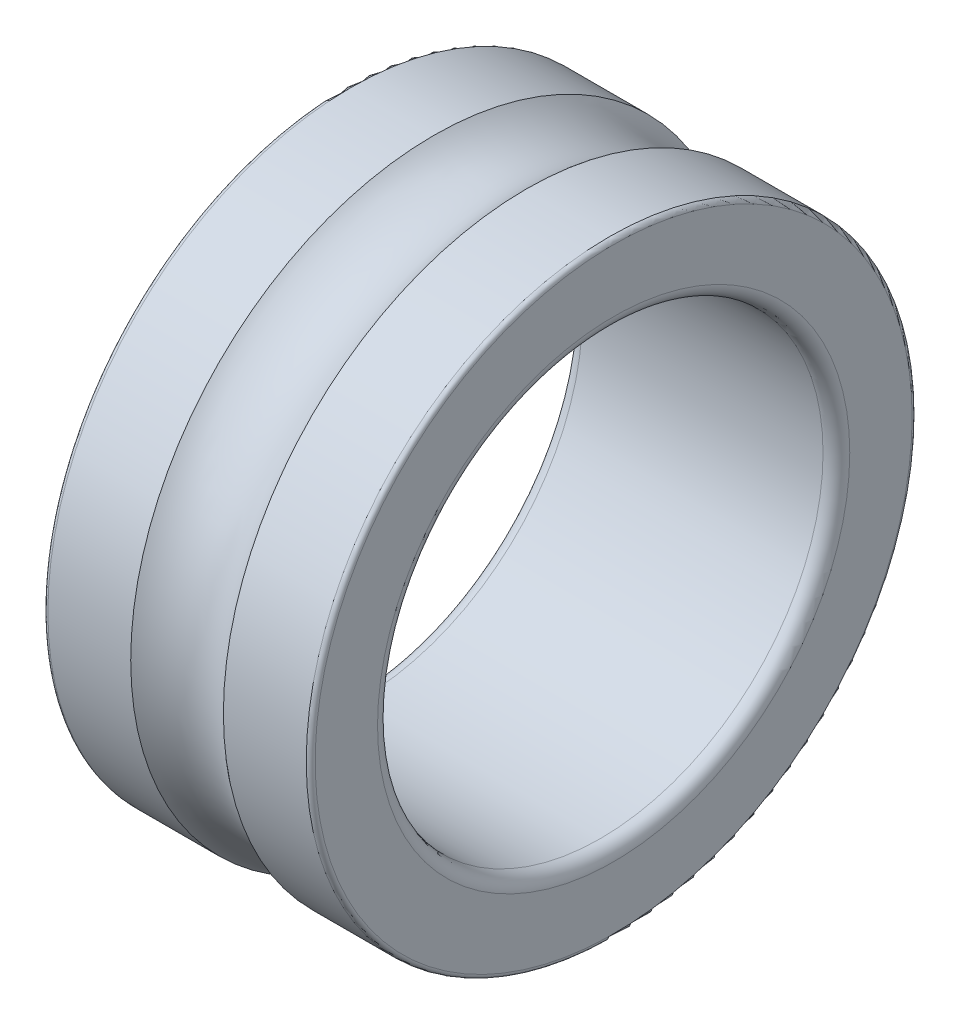
ISO-10303-21;
HEADER;
FILE_DESCRIPTION(('STEP AP214'),'2;1');
FILE_NAME('part.step','',(''),(''),'','','');
FILE_SCHEMA(('AUTOMOTIVE_DESIGN { 1 0 10303 214 1 1 1 1 }'));
ENDSEC;
DATA;
#1=APPLICATION_CONTEXT('core data for automotive mechanical design processes');
#2=APPLICATION_PROTOCOL_DEFINITION('international standard','automotive_design',2000,#1);
#3=PRODUCT_CONTEXT('',#1,'mechanical');
#4=PRODUCT('Part','Part','',(#3));
#5=PRODUCT_RELATED_PRODUCT_CATEGORY('part','',(#4));
#6=PRODUCT_DEFINITION_FORMATION('','',#4);
#7=PRODUCT_DEFINITION_CONTEXT('part definition',#1,'design');
#8=PRODUCT_DEFINITION('design','',#6,#7);
#9=PRODUCT_DEFINITION_SHAPE('','',#8);
#10=(LENGTH_UNIT() NAMED_UNIT(*) SI_UNIT(.MILLI.,.METRE.));
#11=(NAMED_UNIT(*) PLANE_ANGLE_UNIT() SI_UNIT($,.RADIAN.));
#12=(NAMED_UNIT(*) SI_UNIT($,.STERADIAN.) SOLID_ANGLE_UNIT());
#13=UNCERTAINTY_MEASURE_WITH_UNIT(LENGTH_MEASURE(1.E-05),#10,'distance_accuracy_value','');
#14=(GEOMETRIC_REPRESENTATION_CONTEXT(3) GLOBAL_UNCERTAINTY_ASSIGNED_CONTEXT((#13)) GLOBAL_UNIT_ASSIGNED_CONTEXT((#10,
#11,#12)) REPRESENTATION_CONTEXT('',''));
#15=CARTESIAN_POINT('',(0.,0.,0.));
#16=DIRECTION('',(0.,0.,1.));
#17=DIRECTION('',(1.,0.,0.));
#18=AXIS2_PLACEMENT_3D('',#15,#16,#17);
#19=CARTESIAN_POINT('',(1.35,0.,0.));
#20=DIRECTION('',(-1.,0.,0.));
#21=DIRECTION('',(0.,0.,1.));
#22=AXIS2_PLACEMENT_3D('',#19,#20,#21);
#23=CYLINDRICAL_SURFACE('',#22,2.5);
#24=CARTESIAN_POINT('',(-1.35,0.,0.));
#25=DIRECTION('',(1.,0.,0.));
#26=DIRECTION('',(0.,0.,-1.));
#27=AXIS2_PLACEMENT_3D('',#24,#25,#26);
#28=CIRCLE('',#27,2.5);
#29=CARTESIAN_POINT('',(-1.35,0.,-2.5));
#30=VERTEX_POINT('',#29);
#31=EDGE_CURVE('E112',#30,#30,#28,.T.);
#32=ORIENTED_EDGE('',*,*,#31,.F.);
#33=EDGE_LOOP('',(#32));
#34=FACE_BOUND('',#33,.T.);
#35=CARTESIAN_POINT('',(1.35,0.,0.));
#36=DIRECTION('',(1.,0.,0.));
#37=DIRECTION('',(0.,0.,-1.));
#38=AXIS2_PLACEMENT_3D('',#35,#36,#37);
#39=CIRCLE('',#38,2.5);
#40=CARTESIAN_POINT('',(1.35,0.,-2.5));
#41=VERTEX_POINT('',#40);
#42=EDGE_CURVE('E116',#41,#41,#39,.F.);
#43=ORIENTED_EDGE('',*,*,#42,.F.);
#44=EDGE_LOOP('',(#43));
#45=FACE_BOUND('',#44,.T.);
#46=ADVANCED_FACE('F14',(#34,#45),#23,.F.);
#47=CARTESIAN_POINT('',(1.35,0.,0.));
#48=DIRECTION('',(1.,0.,0.));
#49=DIRECTION('',(0.,0.,-1.));
#50=AXIS2_PLACEMENT_3D('',#47,#48,#49);
#51=TOROIDAL_SURFACE('',#50,2.65,0.150000000000001);
#52=ORIENTED_EDGE('',*,*,#42,.T.);
#53=EDGE_LOOP('',(#52));
#54=FACE_BOUND('',#53,.T.);
#55=CARTESIAN_POINT('',(1.5,0.,0.));
#56=DIRECTION('',(1.,0.,0.));
#57=DIRECTION('',(0.,0.,-1.));
#58=AXIS2_PLACEMENT_3D('',#55,#56,#57);
#59=CIRCLE('',#58,2.65);
#60=CARTESIAN_POINT('',(1.5,0.,-2.65));
#61=VERTEX_POINT('',#60);
#62=EDGE_CURVE('E115',#61,#61,#59,.F.);
#63=ORIENTED_EDGE('',*,*,#62,.F.);
#64=EDGE_LOOP('',(#63));
#65=FACE_BOUND('',#64,.T.);
#66=ADVANCED_FACE('F132',(#54,#65),#51,.T.);
#67=CARTESIAN_POINT('',(-1.35,0.,0.));
#68=DIRECTION('',(1.,0.,0.));
#69=DIRECTION('',(0.,0.,-1.));
#70=AXIS2_PLACEMENT_3D('',#67,#68,#69);
#71=TOROIDAL_SURFACE('',#70,2.65,0.150000000000001);
#72=CARTESIAN_POINT('',(-1.5,0.,0.));
#73=DIRECTION('',(-1.,0.,0.));
#74=DIRECTION('',(0.,0.,-1.));
#75=AXIS2_PLACEMENT_3D('',#72,#73,#74);
#76=CIRCLE('',#75,2.65);
#77=CARTESIAN_POINT('',(-1.5,0.,-2.65));
#78=VERTEX_POINT('',#77);
#79=EDGE_CURVE('E121',#78,#78,#76,.F.);
#80=ORIENTED_EDGE('',*,*,#79,.F.);
#81=EDGE_LOOP('',(#80));
#82=FACE_BOUND('',#81,.T.);
#83=ORIENTED_EDGE('',*,*,#31,.T.);
#84=EDGE_LOOP('',(#83));
#85=FACE_BOUND('',#84,.T.);
#86=ADVANCED_FACE('F87',(#82,#85),#71,.T.);
#87=CARTESIAN_POINT('',(1.5,2.65,0.));
#88=DIRECTION('',(1.,0.,0.));
#89=DIRECTION('',(0.,0.,-1.));
#90=AXIS2_PLACEMENT_3D('',#87,#88,#89);
#91=PLANE('',#90);
#92=ORIENTED_EDGE('',*,*,#62,.T.);
#93=EDGE_LOOP('',(#92));
#94=FACE_BOUND('',#93,.T.);
#95=CARTESIAN_POINT('',(1.5,0.,0.));
#96=DIRECTION('',(-1.,0.,0.));
#97=DIRECTION('',(0.,0.,-1.));
#98=AXIS2_PLACEMENT_3D('',#95,#96,#97);
#99=CIRCLE('',#98,3.35);
#100=CARTESIAN_POINT('',(1.5,0.,-3.35));
#101=VERTEX_POINT('',#100);
#102=EDGE_CURVE('E70',#101,#101,#99,.T.);
#103=ORIENTED_EDGE('',*,*,#102,.F.);
#104=EDGE_LOOP('',(#103));
#105=FACE_BOUND('',#104,.T.);
#106=ADVANCED_FACE('F77',(#94,#105),#91,.T.);
#107=CARTESIAN_POINT('',(-1.5,3.35,0.));
#108=DIRECTION('',(-1.,0.,0.));
#109=DIRECTION('',(0.,0.,1.));
#110=AXIS2_PLACEMENT_3D('',#107,#108,#109);
#111=PLANE('',#110);
#112=CARTESIAN_POINT('',(-1.5,0.,0.));
#113=DIRECTION('',(1.,0.,0.));
#114=DIRECTION('',(0.,0.,-1.));
#115=AXIS2_PLACEMENT_3D('',#112,#113,#114);
#116=CIRCLE('',#115,3.35);
#117=CARTESIAN_POINT('',(-1.5,0.,-3.35));
#118=VERTEX_POINT('',#117);
#119=EDGE_CURVE('E37',#118,#118,#116,.T.);
#120=ORIENTED_EDGE('',*,*,#119,.F.);
#121=EDGE_LOOP('',(#120));
#122=FACE_BOUND('',#121,.T.);
#123=ORIENTED_EDGE('',*,*,#79,.T.);
#124=EDGE_LOOP('',(#123));
#125=FACE_BOUND('',#124,.T.);
#126=ADVANCED_FACE('F86',(#122,#125),#111,.T.);
#127=CARTESIAN_POINT('',(1.45,0.,0.));
#128=DIRECTION('',(1.,0.,0.));
#129=DIRECTION('',(0.,0.,-1.));
#130=AXIS2_PLACEMENT_3D('',#127,#128,#129);
#131=TOROIDAL_SURFACE('',#130,3.35,0.0499999999999997);
#132=ORIENTED_EDGE('',*,*,#102,.T.);
#133=EDGE_LOOP('',(#132));
#134=FACE_BOUND('',#133,.T.);
#135=CARTESIAN_POINT('',(1.45,0.,0.));
#136=DIRECTION('',(-1.,0.,0.));
#137=DIRECTION('',(0.,0.,1.));
#138=AXIS2_PLACEMENT_3D('',#135,#136,#137);
#139=CIRCLE('',#138,3.4);
#140=CARTESIAN_POINT('',(1.45,0.,3.4));
#141=VERTEX_POINT('',#140);
#142=EDGE_CURVE('E34',#141,#141,#139,.T.);
#143=ORIENTED_EDGE('',*,*,#142,.F.);
#144=EDGE_LOOP('',(#143));
#145=FACE_BOUND('',#144,.T.);
#146=ADVANCED_FACE('F49',(#134,#145),#131,.T.);
#147=CARTESIAN_POINT('',(-1.45,0.,0.));
#148=DIRECTION('',(1.,0.,0.));
#149=DIRECTION('',(0.,0.,-1.));
#150=AXIS2_PLACEMENT_3D('',#147,#148,#149);
#151=TOROIDAL_SURFACE('',#150,3.35,0.0499999999999997);
#152=CARTESIAN_POINT('',(-1.45,0.,0.));
#153=DIRECTION('',(-1.,0.,0.));
#154=DIRECTION('',(0.,0.,1.));
#155=AXIS2_PLACEMENT_3D('',#152,#153,#154);
#156=CIRCLE('',#155,3.4);
#157=CARTESIAN_POINT('',(-1.45,0.,3.4));
#158=VERTEX_POINT('',#157);
#159=EDGE_CURVE('E27',#158,#158,#156,.F.);
#160=ORIENTED_EDGE('',*,*,#159,.F.);
#161=EDGE_LOOP('',(#160));
#162=FACE_BOUND('',#161,.T.);
#163=ORIENTED_EDGE('',*,*,#119,.T.);
#164=EDGE_LOOP('',(#163));
#165=FACE_BOUND('',#164,.T.);
#166=ADVANCED_FACE('F43',(#162,#165),#151,.T.);
#167=CARTESIAN_POINT('',(1.35,0.,0.));
#168=DIRECTION('',(-1.,0.,0.));
#169=DIRECTION('',(0.,0.,1.));
#170=AXIS2_PLACEMENT_3D('',#167,#168,#169);
#171=CYLINDRICAL_SURFACE('',#170,3.4);
#172=CARTESIAN_POINT('',(0.520034614232553,0.,0.));
#173=DIRECTION('',(1.,0.,0.));
#174=DIRECTION('',(0.,0.,-1.));
#175=AXIS2_PLACEMENT_3D('',#172,#173,#174);
#176=CIRCLE('',#175,3.4);
#177=CARTESIAN_POINT('',(0.520034614232553,0.,-3.4));
#178=VERTEX_POINT('',#177);
#179=EDGE_CURVE('E22',#178,#178,#176,.T.);
#180=ORIENTED_EDGE('',*,*,#179,.T.);
#181=EDGE_LOOP('',(#180));
#182=FACE_BOUND('',#181,.T.);
#183=ORIENTED_EDGE('',*,*,#142,.T.);
#184=EDGE_LOOP('',(#183));
#185=FACE_BOUND('',#184,.T.);
#186=ADVANCED_FACE('F48',(#182,#185),#171,.T.);
#187=CARTESIAN_POINT('',(1.35,0.,0.));
#188=DIRECTION('',(-1.,0.,0.));
#189=DIRECTION('',(0.,0.,1.));
#190=AXIS2_PLACEMENT_3D('',#187,#188,#189);
#191=CYLINDRICAL_SURFACE('',#190,3.4);
#192=ORIENTED_EDGE('',*,*,#159,.T.);
#193=EDGE_LOOP('',(#192));
#194=FACE_BOUND('',#193,.T.);
#195=CARTESIAN_POINT('',(-0.520034614232553,0.,0.));
#196=DIRECTION('',(1.,0.,0.));
#197=DIRECTION('',(0.,0.,-1.));
#198=AXIS2_PLACEMENT_3D('',#195,#196,#197);
#199=CIRCLE('',#198,3.4);
#200=CARTESIAN_POINT('',(-0.520034614232553,0.,-3.4));
#201=VERTEX_POINT('',#200);
#202=EDGE_CURVE('E9',#201,#201,#199,.F.);
#203=ORIENTED_EDGE('',*,*,#202,.T.);
#204=EDGE_LOOP('',(#203));
#205=FACE_BOUND('',#204,.T.);
#206=ADVANCED_FACE('F146',(#194,#205),#191,.T.);
#207=CARTESIAN_POINT('',(0.,0.,0.));
#208=DIRECTION('',(1.,0.,0.));
#209=DIRECTION('',(0.,0.,-1.));
#210=AXIS2_PLACEMENT_3D('',#207,#208,#209);
#211=TOROIDAL_SURFACE('',#210,4.,0.794000000000001);
#212=ORIENTED_EDGE('',*,*,#202,.F.);
#213=EDGE_LOOP('',(#212));
#214=FACE_BOUND('',#213,.T.);
#215=ORIENTED_EDGE('',*,*,#179,.F.);
#216=EDGE_LOOP('',(#215));
#217=FACE_BOUND('',#216,.T.);
#218=ADVANCED_FACE('F144',(#214,#217),#211,.F.);
#219=CLOSED_SHELL('',(#46,#66,#86,#106,#126,#146,#166,#186,#206,#218));
#220=MANIFOLD_SOLID_BREP('B1',#219);
#221=ADVANCED_BREP_SHAPE_REPRESENTATION('',(#18,#220),#14);
#222=SHAPE_DEFINITION_REPRESENTATION(#9,#221);
ENDSEC;
END-ISO-10303-21;
